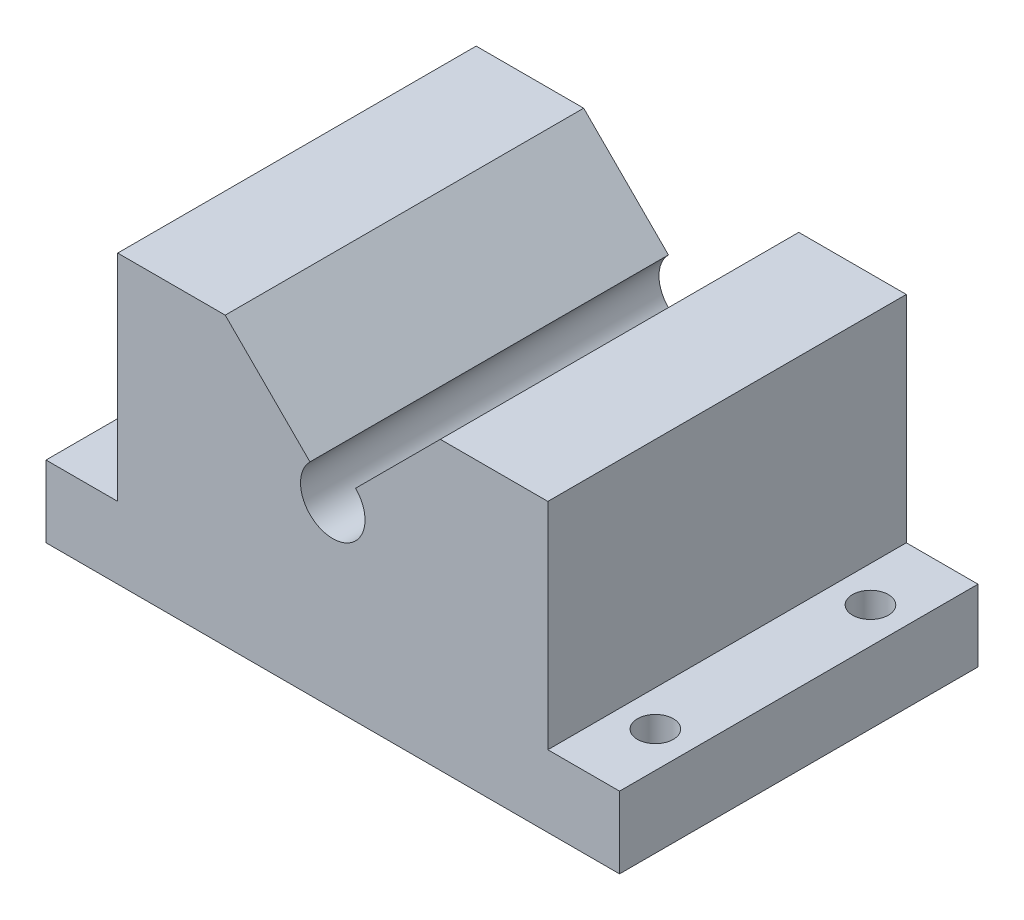
ISO-10303-21;
HEADER;
FILE_DESCRIPTION(('STEP AP214'),'2;1');
FILE_NAME('part.step','',(''),(''),'','','');
FILE_SCHEMA(('AUTOMOTIVE_DESIGN { 1 0 10303 214 1 1 1 1 }'));
ENDSEC;
DATA;
#1=APPLICATION_CONTEXT('core data for automotive mechanical design processes');
#2=APPLICATION_PROTOCOL_DEFINITION('international standard','automotive_design',2000,#1);
#3=PRODUCT_CONTEXT('',#1,'mechanical');
#4=PRODUCT('Part','Part','',(#3));
#5=PRODUCT_RELATED_PRODUCT_CATEGORY('part','',(#4));
#6=PRODUCT_DEFINITION_FORMATION('','',#4);
#7=PRODUCT_DEFINITION_CONTEXT('part definition',#1,'design');
#8=PRODUCT_DEFINITION('design','',#6,#7);
#9=PRODUCT_DEFINITION_SHAPE('','',#8);
#10=(LENGTH_UNIT() NAMED_UNIT(*) SI_UNIT(.MILLI.,.METRE.));
#11=(NAMED_UNIT(*) PLANE_ANGLE_UNIT() SI_UNIT($,.RADIAN.));
#12=(NAMED_UNIT(*) SI_UNIT($,.STERADIAN.) SOLID_ANGLE_UNIT());
#13=UNCERTAINTY_MEASURE_WITH_UNIT(LENGTH_MEASURE(1.E-05),#10,'distance_accuracy_value','');
#14=(GEOMETRIC_REPRESENTATION_CONTEXT(3) GLOBAL_UNCERTAINTY_ASSIGNED_CONTEXT((#13)) GLOBAL_UNIT_ASSIGNED_CONTEXT((#10,
#11,#12)) REPRESENTATION_CONTEXT('',''));
#15=CARTESIAN_POINT('',(0.,0.,0.));
#16=DIRECTION('',(0.,0.,1.));
#17=DIRECTION('',(1.,0.,0.));
#18=AXIS2_PLACEMENT_3D('',#15,#16,#17);
#19=CARTESIAN_POINT('',(0.,40.,50.));
#20=DIRECTION('',(0.,1.,0.));
#21=DIRECTION('',(0.,0.,1.));
#22=AXIS2_PLACEMENT_3D('',#19,#20,#21);
#23=PLANE('',#22);
#24=DIRECTION('',(1.,0.,0.));
#25=VECTOR('',#24,1.);
#26=CARTESIAN_POINT('',(0.,40.,50.));
#27=LINE('',#26,#25);
#28=CARTESIAN_POINT('',(-30.,40.,50.));
#29=VERTEX_POINT('',#28);
#30=CARTESIAN_POINT('',(-15.,40.,50.));
#31=VERTEX_POINT('',#30);
#32=EDGE_CURVE('E136',#29,#31,#27,.T.);
#33=ORIENTED_EDGE('',*,*,#32,.T.);
#34=DIRECTION('',(0.,0.,1.));
#35=VECTOR('',#34,1.);
#36=CARTESIAN_POINT('',(-15.,40.,-47.));
#37=LINE('',#36,#35);
#38=CARTESIAN_POINT('',(-15.,40.,0.));
#39=VERTEX_POINT('',#38);
#40=EDGE_CURVE('E147',#39,#31,#37,.T.);
#41=ORIENTED_EDGE('',*,*,#40,.F.);
#42=DIRECTION('',(1.,0.,0.));
#43=VECTOR('',#42,1.);
#44=CARTESIAN_POINT('',(0.,40.,0.));
#45=LINE('',#44,#43);
#46=CARTESIAN_POINT('',(-30.,40.,0.));
#47=VERTEX_POINT('',#46);
#48=EDGE_CURVE('E157',#47,#39,#45,.T.);
#49=ORIENTED_EDGE('',*,*,#48,.F.);
#50=DIRECTION('',(0.,0.,-1.));
#51=VECTOR('',#50,1.);
#52=CARTESIAN_POINT('',(-30.,40.,50.));
#53=LINE('',#52,#51);
#54=EDGE_CURVE('E124',#29,#47,#53,.T.);
#55=ORIENTED_EDGE('',*,*,#54,.F.);
#56=EDGE_LOOP('',(#33,#41,#49,#55));
#57=FACE_BOUND('',#56,.T.);
#58=ADVANCED_FACE('F35',(#57),#23,.T.);
#59=CARTESIAN_POINT('',(0.,0.,50.));
#60=DIRECTION('',(0.,0.,1.));
#61=DIRECTION('',(1.,0.,0.));
#62=AXIS2_PLACEMENT_3D('',#59,#60,#61);
#63=PLANE('',#62);
#64=CARTESIAN_POINT('',(0.,25.,50.));
#65=DIRECTION('',(0.,0.,1.));
#66=DIRECTION('',(1.,0.,0.));
#67=AXIS2_PLACEMENT_3D('',#64,#65,#66);
#68=CIRCLE('',#67,4.5);
#69=CARTESIAN_POINT('',(-3.18198051533942,28.1819805153395,50.));
#70=VERTEX_POINT('',#69);
#71=CARTESIAN_POINT('',(3.18198051533951,28.1819805153395,50.));
#72=VERTEX_POINT('',#71);
#73=EDGE_CURVE('E249',#70,#72,#68,.T.);
#74=ORIENTED_EDGE('',*,*,#73,.F.);
#75=DIRECTION('',(-0.707106781186549,0.707106781186546,0.));
#76=VECTOR('',#75,1.);
#77=CARTESIAN_POINT('',(12.5,12.5000000000001,50.));
#78=LINE('',#77,#76);
#79=EDGE_CURVE('E248',#70,#31,#78,.T.);
#80=ORIENTED_EDGE('',*,*,#79,.T.);
#81=ORIENTED_EDGE('',*,*,#32,.F.);
#82=DIRECTION('',(0.,1.,0.));
#83=VECTOR('',#82,1.);
#84=CARTESIAN_POINT('',(-30.,0.,50.));
#85=LINE('',#84,#83);
#86=CARTESIAN_POINT('',(-30.,10.,50.));
#87=VERTEX_POINT('',#86);
#88=EDGE_CURVE('E117',#87,#29,#85,.T.);
#89=ORIENTED_EDGE('',*,*,#88,.F.);
#90=DIRECTION('',(1.,0.,0.));
#91=VECTOR('',#90,1.);
#92=CARTESIAN_POINT('',(0.,10.,50.));
#93=LINE('',#92,#91);
#94=CARTESIAN_POINT('',(-40.,10.,50.));
#95=VERTEX_POINT('',#94);
#96=EDGE_CURVE('E133',#95,#87,#93,.T.);
#97=ORIENTED_EDGE('',*,*,#96,.F.);
#98=DIRECTION('',(0.,1.,0.));
#99=VECTOR('',#98,1.);
#100=CARTESIAN_POINT('',(-40.,0.,50.));
#101=LINE('',#100,#99);
#102=CARTESIAN_POINT('',(-40.,0.,50.));
#103=VERTEX_POINT('',#102);
#104=EDGE_CURVE('E139',#103,#95,#101,.T.);
#105=ORIENTED_EDGE('',*,*,#104,.F.);
#106=DIRECTION('',(-1.,0.,0.));
#107=VECTOR('',#106,1.);
#108=CARTESIAN_POINT('',(0.,0.,50.));
#109=LINE('',#108,#107);
#110=CARTESIAN_POINT('',(40.,0.,50.));
#111=VERTEX_POINT('',#110);
#112=EDGE_CURVE('E166',#111,#103,#109,.T.);
#113=ORIENTED_EDGE('',*,*,#112,.F.);
#114=DIRECTION('',(0.,-1.,0.));
#115=VECTOR('',#114,1.);
#116=CARTESIAN_POINT('',(40.,0.,50.));
#117=LINE('',#116,#115);
#118=CARTESIAN_POINT('',(40.,10.,50.));
#119=VERTEX_POINT('',#118);
#120=EDGE_CURVE('E213',#119,#111,#117,.T.);
#121=ORIENTED_EDGE('',*,*,#120,.F.);
#122=DIRECTION('',(1.,0.,0.));
#123=VECTOR('',#122,1.);
#124=CARTESIAN_POINT('',(0.,10.,50.));
#125=LINE('',#124,#123);
#126=CARTESIAN_POINT('',(30.,10.,50.));
#127=VERTEX_POINT('',#126);
#128=EDGE_CURVE('E208',#127,#119,#125,.T.);
#129=ORIENTED_EDGE('',*,*,#128,.F.);
#130=DIRECTION('',(0.,-1.,0.));
#131=VECTOR('',#130,1.);
#132=CARTESIAN_POINT('',(30.,0.,50.));
#133=LINE('',#132,#131);
#134=CARTESIAN_POINT('',(30.,40.,50.));
#135=VERTEX_POINT('',#134);
#136=EDGE_CURVE('E235',#135,#127,#133,.T.);
#137=ORIENTED_EDGE('',*,*,#136,.F.);
#138=CARTESIAN_POINT('',(15.,40.,50.));
#139=VERTEX_POINT('',#138);
#140=EDGE_CURVE('E197',#139,#135,#27,.T.);
#141=ORIENTED_EDGE('',*,*,#140,.F.);
#142=DIRECTION('',(0.707106781186546,0.707106781186549,0.));
#143=VECTOR('',#142,1.);
#144=CARTESIAN_POINT('',(-12.5,12.4999999999999,50.));
#145=LINE('',#144,#143);
#146=EDGE_CURVE('E225',#72,#139,#145,.T.);
#147=ORIENTED_EDGE('',*,*,#146,.F.);
#148=EDGE_LOOP('',(#74,#80,#81,#89,#97,#105,#113,#121,#129,#137,#141,#147));
#149=FACE_BOUND('',#148,.T.);
#150=ADVANCED_FACE('F131',(#149),#63,.T.);
#151=CARTESIAN_POINT('',(0.,0.,0.));
#152=DIRECTION('',(0.,0.,1.));
#153=DIRECTION('',(1.,0.,0.));
#154=AXIS2_PLACEMENT_3D('',#151,#152,#153);
#155=PLANE('',#154);
#156=DIRECTION('',(-0.707106781186549,0.707106781186546,0.));
#157=VECTOR('',#156,1.);
#158=CARTESIAN_POINT('',(12.5,12.5000000000001,0.));
#159=LINE('',#158,#157);
#160=CARTESIAN_POINT('',(-3.18198051533942,28.1819805153395,0.));
#161=VERTEX_POINT('',#160);
#162=EDGE_CURVE('E11',#161,#39,#159,.T.);
#163=ORIENTED_EDGE('',*,*,#162,.F.);
#164=CARTESIAN_POINT('',(0.,25.,0.));
#165=DIRECTION('',(0.,0.,1.));
#166=DIRECTION('',(1.,0.,0.));
#167=AXIS2_PLACEMENT_3D('',#164,#165,#166);
#168=CIRCLE('',#167,4.5);
#169=CARTESIAN_POINT('',(3.18198051533951,28.1819805153395,0.));
#170=VERTEX_POINT('',#169);
#171=EDGE_CURVE('E178',#161,#170,#168,.T.);
#172=ORIENTED_EDGE('',*,*,#171,.T.);
#173=DIRECTION('',(0.707106781186546,0.707106781186549,0.));
#174=VECTOR('',#173,1.);
#175=CARTESIAN_POINT('',(-12.5,12.4999999999999,0.));
#176=LINE('',#175,#174);
#177=CARTESIAN_POINT('',(15.,40.,0.));
#178=VERTEX_POINT('',#177);
#179=EDGE_CURVE('E43',#170,#178,#176,.T.);
#180=ORIENTED_EDGE('',*,*,#179,.T.);
#181=CARTESIAN_POINT('',(30.,40.,0.));
#182=VERTEX_POINT('',#181);
#183=EDGE_CURVE('E156',#178,#182,#45,.T.);
#184=ORIENTED_EDGE('',*,*,#183,.T.);
#185=DIRECTION('',(0.,-1.,0.));
#186=VECTOR('',#185,1.);
#187=CARTESIAN_POINT('',(30.,0.,0.));
#188=LINE('',#187,#186);
#189=CARTESIAN_POINT('',(30.,10.,0.));
#190=VERTEX_POINT('',#189);
#191=EDGE_CURVE('E153',#182,#190,#188,.T.);
#192=ORIENTED_EDGE('',*,*,#191,.T.);
#193=DIRECTION('',(1.,0.,0.));
#194=VECTOR('',#193,1.);
#195=CARTESIAN_POINT('',(0.,10.,0.));
#196=LINE('',#195,#194);
#197=CARTESIAN_POINT('',(40.,10.,0.));
#198=VERTEX_POINT('',#197);
#199=EDGE_CURVE('E150',#190,#198,#196,.T.);
#200=ORIENTED_EDGE('',*,*,#199,.T.);
#201=DIRECTION('',(0.,-1.,0.));
#202=VECTOR('',#201,1.);
#203=CARTESIAN_POINT('',(40.,0.,0.));
#204=LINE('',#203,#202);
#205=CARTESIAN_POINT('',(40.,0.,0.));
#206=VERTEX_POINT('',#205);
#207=EDGE_CURVE('E146',#198,#206,#204,.T.);
#208=ORIENTED_EDGE('',*,*,#207,.T.);
#209=DIRECTION('',(-1.,0.,0.));
#210=VECTOR('',#209,1.);
#211=CARTESIAN_POINT('',(0.,0.,0.));
#212=LINE('',#211,#210);
#213=CARTESIAN_POINT('',(-40.,0.,0.));
#214=VERTEX_POINT('',#213);
#215=EDGE_CURVE('E144',#206,#214,#212,.T.);
#216=ORIENTED_EDGE('',*,*,#215,.T.);
#217=DIRECTION('',(0.,1.,0.));
#218=VECTOR('',#217,1.);
#219=CARTESIAN_POINT('',(-40.,0.,0.));
#220=LINE('',#219,#218);
#221=CARTESIAN_POINT('',(-40.,10.,0.));
#222=VERTEX_POINT('',#221);
#223=EDGE_CURVE('E163',#214,#222,#220,.T.);
#224=ORIENTED_EDGE('',*,*,#223,.T.);
#225=DIRECTION('',(1.,0.,0.));
#226=VECTOR('',#225,1.);
#227=CARTESIAN_POINT('',(0.,10.,0.));
#228=LINE('',#227,#226);
#229=CARTESIAN_POINT('',(-30.,10.,0.));
#230=VERTEX_POINT('',#229);
#231=EDGE_CURVE('E161',#222,#230,#228,.T.);
#232=ORIENTED_EDGE('',*,*,#231,.T.);
#233=DIRECTION('',(0.,1.,0.));
#234=VECTOR('',#233,1.);
#235=CARTESIAN_POINT('',(-30.,0.,0.));
#236=LINE('',#235,#234);
#237=EDGE_CURVE('E119',#230,#47,#236,.T.);
#238=ORIENTED_EDGE('',*,*,#237,.T.);
#239=ORIENTED_EDGE('',*,*,#48,.T.);
#240=EDGE_LOOP('',(#163,#172,#180,#184,#192,#200,#208,#216,#224,#232,#238,#239));
#241=FACE_BOUND('',#240,.T.);
#242=ADVANCED_FACE('F185',(#241),#155,.F.);
#243=CARTESIAN_POINT('',(0.,0.,50.));
#244=DIRECTION('',(0.,-1.,0.));
#245=DIRECTION('',(1.,0.,0.));
#246=AXIS2_PLACEMENT_3D('',#243,#244,#245);
#247=PLANE('',#246);
#248=CARTESIAN_POINT('',(35.,0.,40.));
#249=DIRECTION('',(0.,-1.,0.));
#250=DIRECTION('',(1.,0.,0.));
#251=AXIS2_PLACEMENT_3D('',#248,#249,#250);
#252=CIRCLE('',#251,2.5);
#253=CARTESIAN_POINT('',(37.5,0.,40.));
#254=VERTEX_POINT('',#253);
#255=EDGE_CURVE('E270',#254,#254,#252,.T.);
#256=ORIENTED_EDGE('',*,*,#255,.F.);
#257=EDGE_LOOP('',(#256));
#258=FACE_BOUND('',#257,.T.);
#259=CARTESIAN_POINT('',(35.,0.,10.));
#260=DIRECTION('',(0.,-1.,0.));
#261=DIRECTION('',(1.,0.,0.));
#262=AXIS2_PLACEMENT_3D('',#259,#260,#261);
#263=CIRCLE('',#262,2.5);
#264=CARTESIAN_POINT('',(37.5,0.,10.));
#265=VERTEX_POINT('',#264);
#266=EDGE_CURVE('E264',#265,#265,#263,.T.);
#267=ORIENTED_EDGE('',*,*,#266,.F.);
#268=EDGE_LOOP('',(#267));
#269=FACE_BOUND('',#268,.T.);
#270=CARTESIAN_POINT('',(-35.,0.,40.));
#271=DIRECTION('',(0.,-1.,0.));
#272=DIRECTION('',(1.,0.,0.));
#273=AXIS2_PLACEMENT_3D('',#270,#271,#272);
#274=CIRCLE('',#273,2.5);
#275=CARTESIAN_POINT('',(-32.5,0.,40.));
#276=VERTEX_POINT('',#275);
#277=EDGE_CURVE('E258',#276,#276,#274,.T.);
#278=ORIENTED_EDGE('',*,*,#277,.F.);
#279=EDGE_LOOP('',(#278));
#280=FACE_BOUND('',#279,.T.);
#281=CARTESIAN_POINT('',(-35.,0.,10.));
#282=DIRECTION('',(0.,-1.,0.));
#283=DIRECTION('',(1.,0.,0.));
#284=AXIS2_PLACEMENT_3D('',#281,#282,#283);
#285=CIRCLE('',#284,2.5);
#286=CARTESIAN_POINT('',(-32.5,0.,10.));
#287=VERTEX_POINT('',#286);
#288=EDGE_CURVE('E250',#287,#287,#285,.T.);
#289=ORIENTED_EDGE('',*,*,#288,.F.);
#290=EDGE_LOOP('',(#289));
#291=FACE_BOUND('',#290,.T.);
#292=ORIENTED_EDGE('',*,*,#215,.F.);
#293=DIRECTION('',(0.,0.,-1.));
#294=VECTOR('',#293,1.);
#295=CARTESIAN_POINT('',(40.,0.,50.));
#296=LINE('',#295,#294);
#297=EDGE_CURVE('E95',#111,#206,#296,.T.);
#298=ORIENTED_EDGE('',*,*,#297,.F.);
#299=ORIENTED_EDGE('',*,*,#112,.T.);
#300=DIRECTION('',(0.,0.,-1.));
#301=VECTOR('',#300,1.);
#302=CARTESIAN_POINT('',(-40.,0.,50.));
#303=LINE('',#302,#301);
#304=EDGE_CURVE('E59',#103,#214,#303,.T.);
#305=ORIENTED_EDGE('',*,*,#304,.T.);
#306=EDGE_LOOP('',(#292,#298,#299,#305));
#307=FACE_BOUND('',#306,.T.);
#308=ADVANCED_FACE('F37',(#258,#269,#280,#291,#307),#247,.T.);
#309=CARTESIAN_POINT('',(40.,0.,50.));
#310=DIRECTION('',(1.,0.,0.));
#311=DIRECTION('',(0.,1.,0.));
#312=AXIS2_PLACEMENT_3D('',#309,#310,#311);
#313=PLANE('',#312);
#314=ORIENTED_EDGE('',*,*,#207,.F.);
#315=DIRECTION('',(0.,0.,-1.));
#316=VECTOR('',#315,1.);
#317=CARTESIAN_POINT('',(40.,10.,50.));
#318=LINE('',#317,#316);
#319=EDGE_CURVE('E175',#119,#198,#318,.T.);
#320=ORIENTED_EDGE('',*,*,#319,.F.);
#321=ORIENTED_EDGE('',*,*,#120,.T.);
#322=ORIENTED_EDGE('',*,*,#297,.T.);
#323=EDGE_LOOP('',(#314,#320,#321,#322));
#324=FACE_BOUND('',#323,.T.);
#325=ADVANCED_FACE('F212',(#324),#313,.T.);
#326=CARTESIAN_POINT('',(0.,10.,50.));
#327=DIRECTION('',(0.,1.,0.));
#328=DIRECTION('',(0.,0.,1.));
#329=AXIS2_PLACEMENT_3D('',#326,#327,#328);
#330=PLANE('',#329);
#331=CARTESIAN_POINT('',(35.,10.,40.));
#332=DIRECTION('',(0.,1.,0.));
#333=DIRECTION('',(0.,0.,1.));
#334=AXIS2_PLACEMENT_3D('',#331,#332,#333);
#335=CIRCLE('',#334,2.5);
#336=CARTESIAN_POINT('',(35.,10.,42.5));
#337=VERTEX_POINT('',#336);
#338=EDGE_CURVE('E273',#337,#337,#335,.T.);
#339=ORIENTED_EDGE('',*,*,#338,.F.);
#340=EDGE_LOOP('',(#339));
#341=FACE_BOUND('',#340,.T.);
#342=CARTESIAN_POINT('',(35.,10.,10.));
#343=DIRECTION('',(0.,1.,0.));
#344=DIRECTION('',(0.,0.,1.));
#345=AXIS2_PLACEMENT_3D('',#342,#343,#344);
#346=CIRCLE('',#345,2.5);
#347=CARTESIAN_POINT('',(35.,10.,12.5));
#348=VERTEX_POINT('',#347);
#349=EDGE_CURVE('E267',#348,#348,#346,.T.);
#350=ORIENTED_EDGE('',*,*,#349,.F.);
#351=EDGE_LOOP('',(#350));
#352=FACE_BOUND('',#351,.T.);
#353=ORIENTED_EDGE('',*,*,#199,.F.);
#354=DIRECTION('',(0.,0.,-1.));
#355=VECTOR('',#354,1.);
#356=CARTESIAN_POINT('',(30.,10.,50.));
#357=LINE('',#356,#355);
#358=EDGE_CURVE('E173',#127,#190,#357,.T.);
#359=ORIENTED_EDGE('',*,*,#358,.F.);
#360=ORIENTED_EDGE('',*,*,#128,.T.);
#361=ORIENTED_EDGE('',*,*,#319,.T.);
#362=EDGE_LOOP('',(#353,#359,#360,#361));
#363=FACE_BOUND('',#362,.T.);
#364=ADVANCED_FACE('F205',(#341,#352,#363),#330,.T.);
#365=CARTESIAN_POINT('',(30.,0.,50.));
#366=DIRECTION('',(1.,0.,0.));
#367=DIRECTION('',(0.,1.,0.));
#368=AXIS2_PLACEMENT_3D('',#365,#366,#367);
#369=PLANE('',#368);
#370=ORIENTED_EDGE('',*,*,#191,.F.);
#371=DIRECTION('',(0.,0.,-1.));
#372=VECTOR('',#371,1.);
#373=CARTESIAN_POINT('',(30.,40.,50.));
#374=LINE('',#373,#372);
#375=EDGE_CURVE('E170',#135,#182,#374,.T.);
#376=ORIENTED_EDGE('',*,*,#375,.F.);
#377=ORIENTED_EDGE('',*,*,#136,.T.);
#378=ORIENTED_EDGE('',*,*,#358,.T.);
#379=EDGE_LOOP('',(#370,#376,#377,#378));
#380=FACE_BOUND('',#379,.T.);
#381=ADVANCED_FACE('F201',(#380),#369,.T.);
#382=DIRECTION('',(0.,0.,1.));
#383=VECTOR('',#382,1.);
#384=CARTESIAN_POINT('',(15.,40.,-47.));
#385=LINE('',#384,#383);
#386=EDGE_CURVE('E193',#178,#139,#385,.T.);
#387=ORIENTED_EDGE('',*,*,#386,.T.);
#388=ORIENTED_EDGE('',*,*,#140,.T.);
#389=ORIENTED_EDGE('',*,*,#375,.T.);
#390=ORIENTED_EDGE('',*,*,#183,.F.);
#391=EDGE_LOOP('',(#387,#388,#389,#390));
#392=FACE_BOUND('',#391,.T.);
#393=ADVANCED_FACE('F191',(#392),#23,.T.);
#394=CARTESIAN_POINT('',(-30.,0.,50.));
#395=DIRECTION('',(-1.,0.,0.));
#396=DIRECTION('',(0.,0.,1.));
#397=AXIS2_PLACEMENT_3D('',#394,#395,#396);
#398=PLANE('',#397);
#399=ORIENTED_EDGE('',*,*,#237,.F.);
#400=DIRECTION('',(0.,0.,-1.));
#401=VECTOR('',#400,1.);
#402=CARTESIAN_POINT('',(-30.,10.,50.));
#403=LINE('',#402,#401);
#404=EDGE_CURVE('E114',#87,#230,#403,.T.);
#405=ORIENTED_EDGE('',*,*,#404,.F.);
#406=ORIENTED_EDGE('',*,*,#88,.T.);
#407=ORIENTED_EDGE('',*,*,#54,.T.);
#408=EDGE_LOOP('',(#399,#405,#406,#407));
#409=FACE_BOUND('',#408,.T.);
#410=ADVANCED_FACE('F116',(#409),#398,.T.);
#411=CARTESIAN_POINT('',(0.,10.,50.));
#412=DIRECTION('',(0.,1.,0.));
#413=DIRECTION('',(0.,0.,1.));
#414=AXIS2_PLACEMENT_3D('',#411,#412,#413);
#415=PLANE('',#414);
#416=CARTESIAN_POINT('',(-35.,10.,40.));
#417=DIRECTION('',(0.,1.,0.));
#418=DIRECTION('',(0.,0.,1.));
#419=AXIS2_PLACEMENT_3D('',#416,#417,#418);
#420=CIRCLE('',#419,2.5);
#421=CARTESIAN_POINT('',(-35.,10.,42.5));
#422=VERTEX_POINT('',#421);
#423=EDGE_CURVE('E261',#422,#422,#420,.T.);
#424=ORIENTED_EDGE('',*,*,#423,.F.);
#425=EDGE_LOOP('',(#424));
#426=FACE_BOUND('',#425,.T.);
#427=CARTESIAN_POINT('',(-35.,10.,10.));
#428=DIRECTION('',(0.,1.,0.));
#429=DIRECTION('',(0.,0.,1.));
#430=AXIS2_PLACEMENT_3D('',#427,#428,#429);
#431=CIRCLE('',#430,2.5);
#432=CARTESIAN_POINT('',(-35.,10.,12.5));
#433=VERTEX_POINT('',#432);
#434=EDGE_CURVE('E255',#433,#433,#431,.T.);
#435=ORIENTED_EDGE('',*,*,#434,.F.);
#436=EDGE_LOOP('',(#435));
#437=FACE_BOUND('',#436,.T.);
#438=ORIENTED_EDGE('',*,*,#231,.F.);
#439=DIRECTION('',(0.,0.,-1.));
#440=VECTOR('',#439,1.);
#441=CARTESIAN_POINT('',(-40.,10.,50.));
#442=LINE('',#441,#440);
#443=EDGE_CURVE('E125',#95,#222,#442,.T.);
#444=ORIENTED_EDGE('',*,*,#443,.F.);
#445=ORIENTED_EDGE('',*,*,#96,.T.);
#446=ORIENTED_EDGE('',*,*,#404,.T.);
#447=EDGE_LOOP('',(#438,#444,#445,#446));
#448=FACE_BOUND('',#447,.T.);
#449=ADVANCED_FACE('F138',(#426,#437,#448),#415,.T.);
#450=CARTESIAN_POINT('',(-40.,0.,50.));
#451=DIRECTION('',(-1.,0.,0.));
#452=DIRECTION('',(0.,0.,1.));
#453=AXIS2_PLACEMENT_3D('',#450,#451,#452);
#454=PLANE('',#453);
#455=ORIENTED_EDGE('',*,*,#223,.F.);
#456=ORIENTED_EDGE('',*,*,#304,.F.);
#457=ORIENTED_EDGE('',*,*,#104,.T.);
#458=ORIENTED_EDGE('',*,*,#443,.T.);
#459=EDGE_LOOP('',(#455,#456,#457,#458));
#460=FACE_BOUND('',#459,.T.);
#461=ADVANCED_FACE('F214',(#460),#454,.T.);
#462=CARTESIAN_POINT('',(12.5,12.5000000000001,-47.));
#463=DIRECTION('',(0.707106781186546,0.707106781186549,0.));
#464=DIRECTION('',(-0.707106781186549,0.707106781186546,0.));
#465=AXIS2_PLACEMENT_3D('',#462,#463,#464);
#466=PLANE('',#465);
#467=ORIENTED_EDGE('',*,*,#162,.T.);
#468=ORIENTED_EDGE('',*,*,#40,.T.);
#469=ORIENTED_EDGE('',*,*,#79,.F.);
#470=DIRECTION('',(0.,0.,1.));
#471=VECTOR('',#470,1.);
#472=CARTESIAN_POINT('',(-3.18198051533942,28.1819805153395,-47.));
#473=LINE('',#472,#471);
#474=EDGE_CURVE('E229',#161,#70,#473,.T.);
#475=ORIENTED_EDGE('',*,*,#474,.F.);
#476=EDGE_LOOP('',(#467,#468,#469,#475));
#477=FACE_BOUND('',#476,.T.);
#478=ADVANCED_FACE('F247',(#477),#466,.T.);
#479=CARTESIAN_POINT('',(-12.5,12.4999999999999,-47.));
#480=DIRECTION('',(0.707106781186549,-0.707106781186546,0.));
#481=DIRECTION('',(0.707106781186546,0.707106781186549,0.));
#482=AXIS2_PLACEMENT_3D('',#479,#480,#481);
#483=PLANE('',#482);
#484=DIRECTION('',(0.,0.,1.));
#485=VECTOR('',#484,1.);
#486=CARTESIAN_POINT('',(3.18198051533951,28.1819805153395,-47.));
#487=LINE('',#486,#485);
#488=EDGE_CURVE('E50',#170,#72,#487,.T.);
#489=ORIENTED_EDGE('',*,*,#488,.T.);
#490=ORIENTED_EDGE('',*,*,#146,.T.);
#491=ORIENTED_EDGE('',*,*,#386,.F.);
#492=ORIENTED_EDGE('',*,*,#179,.F.);
#493=EDGE_LOOP('',(#489,#490,#491,#492));
#494=FACE_BOUND('',#493,.T.);
#495=ADVANCED_FACE('F352',(#494),#483,.F.);
#496=CARTESIAN_POINT('',(0.,25.,-47.));
#497=DIRECTION('',(0.,0.,1.));
#498=DIRECTION('',(1.,0.,0.));
#499=AXIS2_PLACEMENT_3D('',#496,#497,#498);
#500=CYLINDRICAL_SURFACE('',#499,4.5);
#501=ORIENTED_EDGE('',*,*,#474,.T.);
#502=ORIENTED_EDGE('',*,*,#73,.T.);
#503=ORIENTED_EDGE('',*,*,#488,.F.);
#504=ORIENTED_EDGE('',*,*,#171,.F.);
#505=EDGE_LOOP('',(#501,#502,#503,#504));
#506=FACE_BOUND('',#505,.T.);
#507=ADVANCED_FACE('F246',(#506),#500,.F.);
#508=CARTESIAN_POINT('',(-35.,-87.,10.));
#509=DIRECTION('',(0.,1.,0.));
#510=DIRECTION('',(0.,0.,1.));
#511=AXIS2_PLACEMENT_3D('',#508,#509,#510);
#512=CYLINDRICAL_SURFACE('',#511,2.5);
#513=ORIENTED_EDGE('',*,*,#288,.T.);
#514=EDGE_LOOP('',(#513));
#515=FACE_BOUND('',#514,.T.);
#516=ORIENTED_EDGE('',*,*,#434,.T.);
#517=EDGE_LOOP('',(#516));
#518=FACE_BOUND('',#517,.T.);
#519=ADVANCED_FACE('F295',(#515,#518),#512,.F.);
#520=CARTESIAN_POINT('',(-35.,-87.,40.));
#521=DIRECTION('',(0.,1.,0.));
#522=DIRECTION('',(0.,0.,1.));
#523=AXIS2_PLACEMENT_3D('',#520,#521,#522);
#524=CYLINDRICAL_SURFACE('',#523,2.5);
#525=ORIENTED_EDGE('',*,*,#277,.T.);
#526=EDGE_LOOP('',(#525));
#527=FACE_BOUND('',#526,.T.);
#528=ORIENTED_EDGE('',*,*,#423,.T.);
#529=EDGE_LOOP('',(#528));
#530=FACE_BOUND('',#529,.T.);
#531=ADVANCED_FACE('F286',(#527,#530),#524,.F.);
#532=CARTESIAN_POINT('',(35.,-87.,10.));
#533=DIRECTION('',(0.,1.,0.));
#534=DIRECTION('',(0.,0.,1.));
#535=AXIS2_PLACEMENT_3D('',#532,#533,#534);
#536=CYLINDRICAL_SURFACE('',#535,2.5);
#537=ORIENTED_EDGE('',*,*,#266,.T.);
#538=EDGE_LOOP('',(#537));
#539=FACE_BOUND('',#538,.T.);
#540=ORIENTED_EDGE('',*,*,#349,.T.);
#541=EDGE_LOOP('',(#540));
#542=FACE_BOUND('',#541,.T.);
#543=ADVANCED_FACE('F284',(#539,#542),#536,.F.);
#544=CARTESIAN_POINT('',(35.,-87.,40.));
#545=DIRECTION('',(0.,1.,0.));
#546=DIRECTION('',(0.,0.,1.));
#547=AXIS2_PLACEMENT_3D('',#544,#545,#546);
#548=CYLINDRICAL_SURFACE('',#547,2.5);
#549=ORIENTED_EDGE('',*,*,#255,.T.);
#550=EDGE_LOOP('',(#549));
#551=FACE_BOUND('',#550,.T.);
#552=ORIENTED_EDGE('',*,*,#338,.T.);
#553=EDGE_LOOP('',(#552));
#554=FACE_BOUND('',#553,.T.);
#555=ADVANCED_FACE('F277',(#551,#554),#548,.F.);
#556=CLOSED_SHELL('',(#58,#150,#242,#308,#325,#364,#381,#393,#410,#449,#461,#478,#495,#507,#519,
#531,#543,#555));
#557=MANIFOLD_SOLID_BREP('B2',#556);
#558=ADVANCED_BREP_SHAPE_REPRESENTATION('',(#18,#557),#14);
#559=SHAPE_DEFINITION_REPRESENTATION(#9,#558);
ENDSEC;
END-ISO-10303-21;
